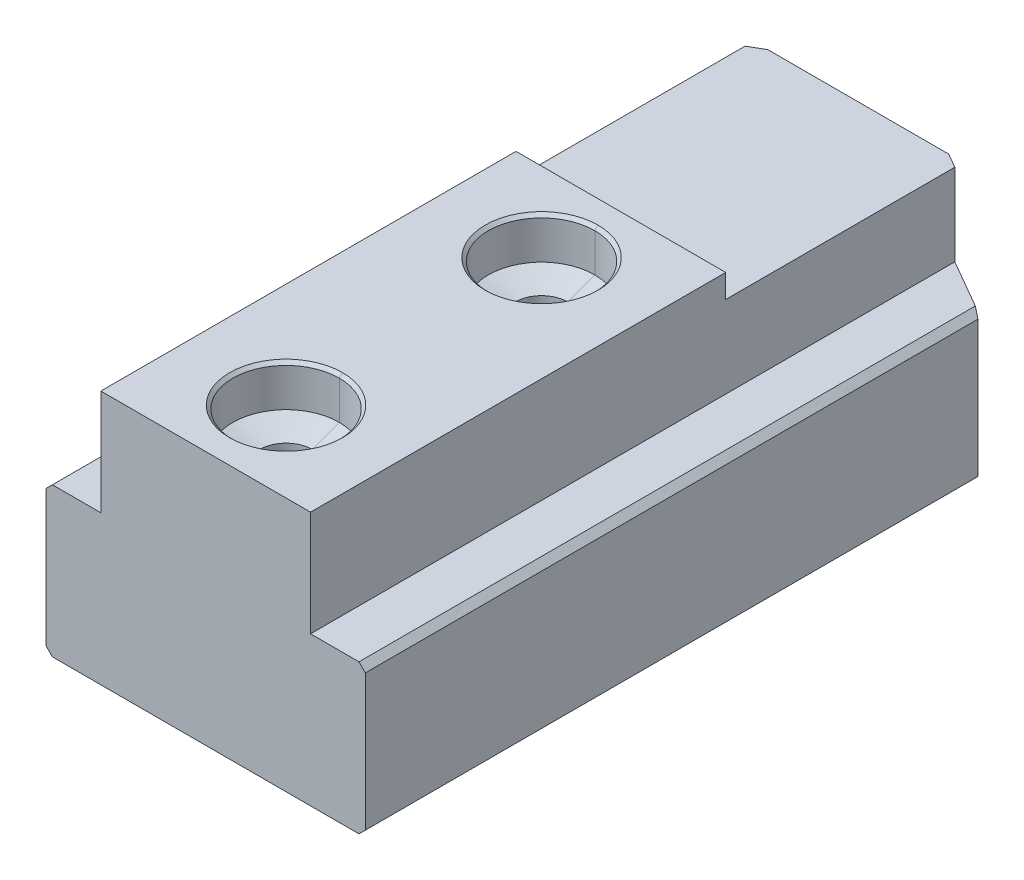
ISO-10303-21;
HEADER;
FILE_DESCRIPTION(('STEP AP214'),'2;1');
FILE_NAME('part.step','',(''),(''),'','','');
FILE_SCHEMA(('AUTOMOTIVE_DESIGN { 1 0 10303 214 1 1 1 1 }'));
ENDSEC;
DATA;
#1=APPLICATION_CONTEXT('core data for automotive mechanical design processes');
#2=APPLICATION_PROTOCOL_DEFINITION('international standard','automotive_design',2000,#1);
#3=PRODUCT_CONTEXT('',#1,'mechanical');
#4=PRODUCT('Part','Part','',(#3));
#5=PRODUCT_RELATED_PRODUCT_CATEGORY('part','',(#4));
#6=PRODUCT_DEFINITION_FORMATION('','',#4);
#7=PRODUCT_DEFINITION_CONTEXT('part definition',#1,'design');
#8=PRODUCT_DEFINITION('design','',#6,#7);
#9=PRODUCT_DEFINITION_SHAPE('','',#8);
#10=(LENGTH_UNIT() NAMED_UNIT(*) SI_UNIT(.MILLI.,.METRE.));
#11=(NAMED_UNIT(*) PLANE_ANGLE_UNIT() SI_UNIT($,.RADIAN.));
#12=(NAMED_UNIT(*) SI_UNIT($,.STERADIAN.) SOLID_ANGLE_UNIT());
#13=UNCERTAINTY_MEASURE_WITH_UNIT(LENGTH_MEASURE(1.E-05),#10,'distance_accuracy_value','');
#14=(GEOMETRIC_REPRESENTATION_CONTEXT(3) GLOBAL_UNCERTAINTY_ASSIGNED_CONTEXT((#13)) GLOBAL_UNIT_ASSIGNED_CONTEXT((#10,
#11,#12)) REPRESENTATION_CONTEXT('',''));
#15=CARTESIAN_POINT('',(0.,0.,0.));
#16=DIRECTION('',(0.,0.,1.));
#17=DIRECTION('',(1.,0.,0.));
#18=AXIS2_PLACEMENT_3D('',#15,#16,#17);
#19=CARTESIAN_POINT('',(0.,0.,0.));
#20=DIRECTION('',(0.,0.,1.));
#21=DIRECTION('',(1.,0.,0.));
#22=AXIS2_PLACEMENT_3D('',#19,#20,#21);
#23=PLANE('',#22);
#24=DIRECTION('',(0.,-1.,0.));
#25=VECTOR('',#24,1.);
#26=CARTESIAN_POINT('',(8.5,23.9,0.));
#27=LINE('',#26,#25);
#28=CARTESIAN_POINT('',(8.5,21.7,0.));
#29=VERTEX_POINT('',#28);
#30=CARTESIAN_POINT('',(8.5,0.,0.));
#31=VERTEX_POINT('',#30);
#32=EDGE_CURVE('E11',#29,#31,#27,.T.);
#33=ORIENTED_EDGE('',*,*,#32,.T.);
#34=DIRECTION('',(1.,0.,0.));
#35=VECTOR('',#34,1.);
#36=CARTESIAN_POINT('',(-14.4,0.,0.));
#37=LINE('',#36,#35);
#38=CARTESIAN_POINT('',(-8.5,0.,0.));
#39=VERTEX_POINT('',#38);
#40=EDGE_CURVE('E26',#39,#31,#37,.T.);
#41=ORIENTED_EDGE('',*,*,#40,.F.);
#42=DIRECTION('',(0.,-1.,0.));
#43=VECTOR('',#42,1.);
#44=CARTESIAN_POINT('',(-8.5,23.9,0.));
#45=LINE('',#44,#43);
#46=CARTESIAN_POINT('',(-8.5,21.7,0.));
#47=VERTEX_POINT('',#46);
#48=EDGE_CURVE('E706',#47,#39,#45,.T.);
#49=ORIENTED_EDGE('',*,*,#48,.F.);
#50=DIRECTION('',(-1.,0.,0.));
#51=VECTOR('',#50,1.);
#52=CARTESIAN_POINT('',(15.,21.7,0.));
#53=LINE('',#52,#51);
#54=EDGE_CURVE('E700',#29,#47,#53,.T.);
#55=ORIENTED_EDGE('',*,*,#54,.F.);
#56=EDGE_LOOP('',(#33,#41,#49,#55));
#57=FACE_BOUND('',#56,.T.);
#58=ADVANCED_FACE('F17',(#57),#23,.F.);
#59=CARTESIAN_POINT('',(0.,21.7,0.));
#60=DIRECTION('',(0.,1.,0.));
#61=DIRECTION('',(0.,0.,1.));
#62=AXIS2_PLACEMENT_3D('',#59,#60,#61);
#63=PLANE('',#62);
#64=DIRECTION('',(0.,0.,-1.));
#65=VECTOR('',#64,1.);
#66=CARTESIAN_POINT('',(9.85,21.7,61.3));
#67=LINE('',#66,#65);
#68=CARTESIAN_POINT('',(9.85,21.7,22.3));
#69=VERTEX_POINT('',#68);
#70=CARTESIAN_POINT('',(9.85,21.7,0.779422863406001));
#71=VERTEX_POINT('',#70);
#72=EDGE_CURVE('E695',#69,#71,#67,.T.);
#73=ORIENTED_EDGE('',*,*,#72,.T.);
#74=DIRECTION('',(-0.866025403784438,0.,-0.500000000000001));
#75=VECTOR('',#74,1.);
#76=CARTESIAN_POINT('',(2.12500000000003,21.7,-3.68060796608388));
#77=LINE('',#76,#75);
#78=EDGE_CURVE('E689',#71,#29,#77,.T.);
#79=ORIENTED_EDGE('',*,*,#78,.T.);
#80=ORIENTED_EDGE('',*,*,#54,.T.);
#81=DIRECTION('',(-0.866025403784438,0.,0.500000000000001));
#82=VECTOR('',#81,1.);
#83=CARTESIAN_POINT('',(-2.12500000000003,21.7,-3.68060796608388));
#84=LINE('',#83,#82);
#85=CARTESIAN_POINT('',(-9.85,21.7,0.77942286340601));
#86=VERTEX_POINT('',#85);
#87=EDGE_CURVE('E684',#47,#86,#84,.T.);
#88=ORIENTED_EDGE('',*,*,#87,.T.);
#89=DIRECTION('',(0.,0.,1.));
#90=VECTOR('',#89,1.);
#91=CARTESIAN_POINT('',(-9.85,21.7,61.3));
#92=LINE('',#91,#90);
#93=CARTESIAN_POINT('',(-9.85,21.7,22.3));
#94=VERTEX_POINT('',#93);
#95=EDGE_CURVE('E679',#86,#94,#92,.T.);
#96=ORIENTED_EDGE('',*,*,#95,.T.);
#97=DIRECTION('',(1.,0.,0.));
#98=VECTOR('',#97,1.);
#99=CARTESIAN_POINT('',(-15.,21.7,22.3));
#100=LINE('',#99,#98);
#101=EDGE_CURVE('E674',#94,#69,#100,.T.);
#102=ORIENTED_EDGE('',*,*,#101,.T.);
#103=EDGE_LOOP('',(#73,#79,#80,#88,#96,#102));
#104=FACE_BOUND('',#103,.T.);
#105=ADVANCED_FACE('F728',(#104),#63,.T.);
#106=CARTESIAN_POINT('',(-15.,21.7,22.3));
#107=DIRECTION('',(0.,0.,1.));
#108=DIRECTION('',(1.,0.,0.));
#109=AXIS2_PLACEMENT_3D('',#106,#107,#108);
#110=PLANE('',#109);
#111=ORIENTED_EDGE('',*,*,#101,.F.);
#112=DIRECTION('',(0.,-1.,0.));
#113=VECTOR('',#112,1.);
#114=CARTESIAN_POINT('',(-9.85,23.9,22.3));
#115=LINE('',#114,#113);
#116=CARTESIAN_POINT('',(-9.85,23.9,22.3));
#117=VERTEX_POINT('',#116);
#118=EDGE_CURVE('E668',#117,#94,#115,.T.);
#119=ORIENTED_EDGE('',*,*,#118,.F.);
#120=DIRECTION('',(1.,0.,0.));
#121=VECTOR('',#120,1.);
#122=CARTESIAN_POINT('',(-15.,23.9,22.3));
#123=LINE('',#122,#121);
#124=CARTESIAN_POINT('',(9.85,23.9,22.3));
#125=VERTEX_POINT('',#124);
#126=EDGE_CURVE('E663',#117,#125,#123,.T.);
#127=ORIENTED_EDGE('',*,*,#126,.T.);
#128=DIRECTION('',(0.,1.,0.));
#129=VECTOR('',#128,1.);
#130=CARTESIAN_POINT('',(9.85,14.,22.3));
#131=LINE('',#130,#129);
#132=EDGE_CURVE('E657',#69,#125,#131,.T.);
#133=ORIENTED_EDGE('',*,*,#132,.F.);
#134=EDGE_LOOP('',(#111,#119,#127,#133));
#135=FACE_BOUND('',#134,.T.);
#136=ADVANCED_FACE('F764',(#135),#110,.F.);
#137=CARTESIAN_POINT('',(9.85,14.,61.3));
#138=DIRECTION('',(-1.,0.,0.));
#139=DIRECTION('',(0.,0.,1.));
#140=AXIS2_PLACEMENT_3D('',#137,#138,#139);
#141=PLANE('',#140);
#142=DIRECTION('',(0.,-1.,0.));
#143=VECTOR('',#142,1.);
#144=CARTESIAN_POINT('',(9.85,14.,0.779422863406001));
#145=LINE('',#144,#143);
#146=CARTESIAN_POINT('',(9.85,14.,0.779422863406001));
#147=VERTEX_POINT('',#146);
#148=EDGE_CURVE('E651',#71,#147,#145,.T.);
#149=ORIENTED_EDGE('',*,*,#148,.F.);
#150=ORIENTED_EDGE('',*,*,#72,.F.);
#151=ORIENTED_EDGE('',*,*,#132,.T.);
#152=DIRECTION('',(0.,0.,-1.));
#153=VECTOR('',#152,1.);
#154=CARTESIAN_POINT('',(9.85,23.9,61.3));
#155=LINE('',#154,#153);
#156=CARTESIAN_POINT('',(9.85,23.9,61.3));
#157=VERTEX_POINT('',#156);
#158=EDGE_CURVE('E645',#157,#125,#155,.T.);
#159=ORIENTED_EDGE('',*,*,#158,.F.);
#160=DIRECTION('',(0.,1.,0.));
#161=VECTOR('',#160,1.);
#162=CARTESIAN_POINT('',(9.85,14.,61.3));
#163=LINE('',#162,#161);
#164=CARTESIAN_POINT('',(9.85,14.,61.3));
#165=VERTEX_POINT('',#164);
#166=EDGE_CURVE('E639',#165,#157,#163,.T.);
#167=ORIENTED_EDGE('',*,*,#166,.F.);
#168=DIRECTION('',(0.,0.,-1.));
#169=VECTOR('',#168,1.);
#170=CARTESIAN_POINT('',(9.85,14.,61.3));
#171=LINE('',#170,#169);
#172=EDGE_CURVE('E634',#165,#147,#171,.T.);
#173=ORIENTED_EDGE('',*,*,#172,.T.);
#174=EDGE_LOOP('',(#149,#150,#151,#159,#167,#173));
#175=FACE_BOUND('',#174,.T.);
#176=ADVANCED_FACE('F767',(#175),#141,.F.);
#177=CARTESIAN_POINT('',(14.4,14.,61.3));
#178=DIRECTION('',(0.,-1.,0.));
#179=DIRECTION('',(0.,0.,-1.));
#180=AXIS2_PLACEMENT_3D('',#177,#178,#179);
#181=PLANE('',#180);
#182=DIRECTION('',(0.866025403784438,0.,0.500000000000001));
#183=VECTOR('',#182,1.);
#184=CARTESIAN_POINT('',(39.4686786259932,14.,17.8797749411643));
#185=LINE('',#184,#183);
#186=CARTESIAN_POINT('',(14.4,14.,3.40636658821883));
#187=VERTEX_POINT('',#186);
#188=EDGE_CURVE('E628',#147,#187,#185,.T.);
#189=ORIENTED_EDGE('',*,*,#188,.F.);
#190=ORIENTED_EDGE('',*,*,#172,.F.);
#191=DIRECTION('',(-1.,0.,0.));
#192=VECTOR('',#191,1.);
#193=CARTESIAN_POINT('',(14.4,14.,61.3));
#194=LINE('',#193,#192);
#195=CARTESIAN_POINT('',(14.4,14.,61.3));
#196=VERTEX_POINT('',#195);
#197=EDGE_CURVE('E622',#196,#165,#194,.T.);
#198=ORIENTED_EDGE('',*,*,#197,.F.);
#199=DIRECTION('',(0.,0.,-1.));
#200=VECTOR('',#199,1.);
#201=CARTESIAN_POINT('',(14.4,14.,61.3));
#202=LINE('',#201,#200);
#203=EDGE_CURVE('E617',#196,#187,#202,.T.);
#204=ORIENTED_EDGE('',*,*,#203,.T.);
#205=EDGE_LOOP('',(#189,#190,#198,#204));
#206=FACE_BOUND('',#205,.T.);
#207=ADVANCED_FACE('F772',(#206),#181,.F.);
#208=CARTESIAN_POINT('',(15.,13.4,61.3));
#209=DIRECTION('',(-0.707106781186549,-0.707106781186547,0.));
#210=DIRECTION('',(0.707106781186547,-0.707106781186549,0.));
#211=AXIS2_PLACEMENT_3D('',#208,#209,#210);
#212=PLANE('',#211);
#213=DIRECTION('',(0.654653670707976,-0.654653670707977,0.377964473009229));
#214=VECTOR('',#213,1.);
#215=CARTESIAN_POINT('',(29.239244929139,-0.83924492913897,11.973808642628));
#216=LINE('',#215,#214);
#217=CARTESIAN_POINT('',(15.,13.4,3.7527767497326));
#218=VERTEX_POINT('',#217);
#219=EDGE_CURVE('E611',#187,#218,#216,.T.);
#220=ORIENTED_EDGE('',*,*,#219,.F.);
#221=ORIENTED_EDGE('',*,*,#203,.F.);
#222=DIRECTION('',(-0.707106781186547,0.707106781186549,0.));
#223=VECTOR('',#222,1.);
#224=CARTESIAN_POINT('',(15.,13.4,61.3));
#225=LINE('',#224,#223);
#226=CARTESIAN_POINT('',(15.,13.4,61.3));
#227=VERTEX_POINT('',#226);
#228=EDGE_CURVE('E605',#227,#196,#225,.T.);
#229=ORIENTED_EDGE('',*,*,#228,.F.);
#230=DIRECTION('',(0.,0.,-1.));
#231=VECTOR('',#230,1.);
#232=CARTESIAN_POINT('',(15.,13.4,61.3));
#233=LINE('',#232,#231);
#234=EDGE_CURVE('E600',#227,#218,#233,.T.);
#235=ORIENTED_EDGE('',*,*,#234,.T.);
#236=EDGE_LOOP('',(#220,#221,#229,#235));
#237=FACE_BOUND('',#236,.T.);
#238=ADVANCED_FACE('F775',(#237),#212,.F.);
#239=CARTESIAN_POINT('',(15.,0.6,61.3));
#240=DIRECTION('',(-1.,0.,0.));
#241=DIRECTION('',(0.,0.,1.));
#242=AXIS2_PLACEMENT_3D('',#239,#240,#241);
#243=PLANE('',#242);
#244=DIRECTION('',(0.,-1.,0.));
#245=VECTOR('',#244,1.);
#246=CARTESIAN_POINT('',(15.,23.9,3.7527767497326));
#247=LINE('',#246,#245);
#248=CARTESIAN_POINT('',(15.,0.600000000000007,3.7527767497326));
#249=VERTEX_POINT('',#248);
#250=EDGE_CURVE('E594',#218,#249,#247,.T.);
#251=ORIENTED_EDGE('',*,*,#250,.F.);
#252=ORIENTED_EDGE('',*,*,#234,.F.);
#253=DIRECTION('',(0.,1.,0.));
#254=VECTOR('',#253,1.);
#255=CARTESIAN_POINT('',(15.,0.6,61.3));
#256=LINE('',#255,#254);
#257=CARTESIAN_POINT('',(15.,0.6,61.3));
#258=VERTEX_POINT('',#257);
#259=EDGE_CURVE('E588',#258,#227,#256,.T.);
#260=ORIENTED_EDGE('',*,*,#259,.F.);
#261=DIRECTION('',(0.,0.,-1.));
#262=VECTOR('',#261,1.);
#263=CARTESIAN_POINT('',(15.,0.6,61.3));
#264=LINE('',#263,#262);
#265=EDGE_CURVE('E583',#258,#249,#264,.T.);
#266=ORIENTED_EDGE('',*,*,#265,.T.);
#267=EDGE_LOOP('',(#251,#252,#260,#266));
#268=FACE_BOUND('',#267,.T.);
#269=ADVANCED_FACE('F778',(#268),#243,.F.);
#270=CARTESIAN_POINT('',(14.4,0.,61.3));
#271=DIRECTION('',(-0.707106781186549,0.707106781186547,0.));
#272=DIRECTION('',(-0.707106781186547,-0.707106781186549,0.));
#273=AXIS2_PLACEMENT_3D('',#270,#271,#272);
#274=PLANE('',#273);
#275=DIRECTION('',(-0.654653670707975,-0.654653670707977,-0.37796447300923));
#276=VECTOR('',#275,1.);
#277=CARTESIAN_POINT('',(28.7249592148532,14.3249592148533,11.6768856470448));
#278=LINE('',#277,#276);
#279=CARTESIAN_POINT('',(14.4,0.,3.40636658821882));
#280=VERTEX_POINT('',#279);
#281=EDGE_CURVE('E577',#249,#280,#278,.T.);
#282=ORIENTED_EDGE('',*,*,#281,.F.);
#283=ORIENTED_EDGE('',*,*,#265,.F.);
#284=DIRECTION('',(0.707106781186547,0.707106781186549,0.));
#285=VECTOR('',#284,1.);
#286=CARTESIAN_POINT('',(14.4,0.,61.3));
#287=LINE('',#286,#285);
#288=CARTESIAN_POINT('',(14.4,0.,61.3));
#289=VERTEX_POINT('',#288);
#290=EDGE_CURVE('E571',#289,#258,#287,.T.);
#291=ORIENTED_EDGE('',*,*,#290,.F.);
#292=DIRECTION('',(0.,0.,-1.));
#293=VECTOR('',#292,1.);
#294=CARTESIAN_POINT('',(14.4,0.,61.3));
#295=LINE('',#294,#293);
#296=EDGE_CURVE('E566',#289,#280,#295,.T.);
#297=ORIENTED_EDGE('',*,*,#296,.T.);
#298=EDGE_LOOP('',(#282,#283,#291,#297));
#299=FACE_BOUND('',#298,.T.);
#300=ADVANCED_FACE('F737',(#299),#274,.F.);
#301=CARTESIAN_POINT('',(-14.4,0.,61.3));
#302=DIRECTION('',(0.,1.,0.));
#303=DIRECTION('',(0.,0.,1.));
#304=AXIS2_PLACEMENT_3D('',#301,#302,#303);
#305=PLANE('',#304);
#306=DIRECTION('',(0.866025403784438,0.,0.500000000000001));
#307=VECTOR('',#306,1.);
#308=CARTESIAN_POINT('',(8.5,0.,0.));
#309=LINE('',#308,#307);
#310=EDGE_CURVE('E560',#31,#280,#309,.T.);
#311=ORIENTED_EDGE('',*,*,#310,.T.);
#312=ORIENTED_EDGE('',*,*,#296,.F.);
#313=DIRECTION('',(1.,0.,0.));
#314=VECTOR('',#313,1.);
#315=CARTESIAN_POINT('',(-14.4,0.,61.3));
#316=LINE('',#315,#314);
#317=CARTESIAN_POINT('',(-14.4,0.,61.3));
#318=VERTEX_POINT('',#317);
#319=EDGE_CURVE('E554',#318,#289,#316,.T.);
#320=ORIENTED_EDGE('',*,*,#319,.F.);
#321=DIRECTION('',(0.,0.,-1.));
#322=VECTOR('',#321,1.);
#323=CARTESIAN_POINT('',(-14.4,0.,61.3));
#324=LINE('',#323,#322);
#325=CARTESIAN_POINT('',(-14.4,0.,3.40636658821882));
#326=VERTEX_POINT('',#325);
#327=EDGE_CURVE('E549',#318,#326,#324,.T.);
#328=ORIENTED_EDGE('',*,*,#327,.T.);
#329=DIRECTION('',(0.866025403784438,0.,-0.500000000000001));
#330=VECTOR('',#329,1.);
#331=CARTESIAN_POINT('',(-15.,0.,3.7527767497326));
#332=LINE('',#331,#330);
#333=EDGE_CURVE('E544',#326,#39,#332,.T.);
#334=ORIENTED_EDGE('',*,*,#333,.T.);
#335=ORIENTED_EDGE('',*,*,#40,.T.);
#336=EDGE_LOOP('',(#311,#312,#320,#328,#334,#335));
#337=FACE_BOUND('',#336,.T.);
#338=ADVANCED_FACE('F718',(#337),#305,.F.);
#339=CARTESIAN_POINT('',(-15.,23.9,3.7527767497326));
#340=DIRECTION('',(-0.500000000000001,0.,-0.866025403784438));
#341=DIRECTION('',(-0.866025403784438,0.,0.500000000000001));
#342=AXIS2_PLACEMENT_3D('',#339,#340,#341);
#343=PLANE('',#342);
#344=DIRECTION('',(-0.654653670707975,0.654653670707977,0.37796447300923));
#345=VECTOR('',#344,1.);
#346=CARTESIAN_POINT('',(-29.239244929139,14.839244929139,11.973808642628));
#347=LINE('',#346,#345);
#348=CARTESIAN_POINT('',(-15.,0.6,3.7527767497326));
#349=VERTEX_POINT('',#348);
#350=EDGE_CURVE('E539',#326,#349,#347,.T.);
#351=ORIENTED_EDGE('',*,*,#350,.T.);
#352=DIRECTION('',(0.,-1.,0.));
#353=VECTOR('',#352,1.);
#354=CARTESIAN_POINT('',(-15.,23.9,3.7527767497326));
#355=LINE('',#354,#353);
#356=CARTESIAN_POINT('',(-15.,13.4,3.7527767497326));
#357=VERTEX_POINT('',#356);
#358=EDGE_CURVE('E533',#357,#349,#355,.T.);
#359=ORIENTED_EDGE('',*,*,#358,.F.);
#360=DIRECTION('',(0.654653670707976,0.654653670707977,-0.377964473009229));
#361=VECTOR('',#360,1.);
#362=CARTESIAN_POINT('',(-28.7249592148532,-0.324959214853256,11.6768856470448));
#363=LINE('',#362,#361);
#364=CARTESIAN_POINT('',(-14.4,14.,3.40636658821883));
#365=VERTEX_POINT('',#364);
#366=EDGE_CURVE('E528',#357,#365,#363,.T.);
#367=ORIENTED_EDGE('',*,*,#366,.T.);
#368=DIRECTION('',(0.866025403784438,0.,-0.500000000000001));
#369=VECTOR('',#368,1.);
#370=CARTESIAN_POINT('',(-36.0561786259931,14.,15.9095671475547));
#371=LINE('',#370,#369);
#372=CARTESIAN_POINT('',(-9.85,14.,0.779422863406008));
#373=VERTEX_POINT('',#372);
#374=EDGE_CURVE('E523',#365,#373,#371,.T.);
#375=ORIENTED_EDGE('',*,*,#374,.T.);
#376=DIRECTION('',(0.,1.,0.));
#377=VECTOR('',#376,1.);
#378=CARTESIAN_POINT('',(-9.85,23.9,0.779422863406008));
#379=LINE('',#378,#377);
#380=EDGE_CURVE('E517',#373,#86,#379,.T.);
#381=ORIENTED_EDGE('',*,*,#380,.T.);
#382=ORIENTED_EDGE('',*,*,#87,.F.);
#383=ORIENTED_EDGE('',*,*,#48,.T.);
#384=ORIENTED_EDGE('',*,*,#333,.F.);
#385=EDGE_LOOP('',(#351,#359,#367,#375,#381,#382,#383,#384));
#386=FACE_BOUND('',#385,.T.);
#387=ADVANCED_FACE('F725',(#386),#343,.T.);
#388=CARTESIAN_POINT('',(-9.85,23.9,61.3));
#389=DIRECTION('',(1.,0.,0.));
#390=DIRECTION('',(0.,0.,-1.));
#391=AXIS2_PLACEMENT_3D('',#388,#389,#390);
#392=PLANE('',#391);
#393=ORIENTED_EDGE('',*,*,#380,.F.);
#394=DIRECTION('',(0.,0.,-1.));
#395=VECTOR('',#394,1.);
#396=CARTESIAN_POINT('',(-9.85,14.,61.3));
#397=LINE('',#396,#395);
#398=CARTESIAN_POINT('',(-9.85,14.,61.3));
#399=VERTEX_POINT('',#398);
#400=EDGE_CURVE('E511',#399,#373,#397,.T.);
#401=ORIENTED_EDGE('',*,*,#400,.F.);
#402=DIRECTION('',(0.,-1.,0.));
#403=VECTOR('',#402,1.);
#404=CARTESIAN_POINT('',(-9.85,23.9,61.3));
#405=LINE('',#404,#403);
#406=CARTESIAN_POINT('',(-9.85,23.9,61.3));
#407=VERTEX_POINT('',#406);
#408=EDGE_CURVE('E505',#407,#399,#405,.T.);
#409=ORIENTED_EDGE('',*,*,#408,.F.);
#410=DIRECTION('',(0.,0.,-1.));
#411=VECTOR('',#410,1.);
#412=CARTESIAN_POINT('',(-9.85,23.9,61.3));
#413=LINE('',#412,#411);
#414=EDGE_CURVE('E499',#407,#117,#413,.T.);
#415=ORIENTED_EDGE('',*,*,#414,.T.);
#416=ORIENTED_EDGE('',*,*,#118,.T.);
#417=ORIENTED_EDGE('',*,*,#95,.F.);
#418=EDGE_LOOP('',(#393,#401,#409,#415,#416,#417));
#419=FACE_BOUND('',#418,.T.);
#420=ADVANCED_FACE('F760',(#419),#392,.F.);
#421=CARTESIAN_POINT('',(9.85,23.9,61.3));
#422=DIRECTION('',(0.,-1.,0.));
#423=DIRECTION('',(0.,0.,-1.));
#424=AXIS2_PLACEMENT_3D('',#421,#422,#423);
#425=PLANE('',#424);
#426=CARTESIAN_POINT('',(0.,23.9,29.75));
#427=DIRECTION('',(0.,-1.,0.));
#428=DIRECTION('',(0.,0.,-1.));
#429=AXIS2_PLACEMENT_3D('',#426,#427,#428);
#430=CIRCLE('',#429,5.3);
#431=CARTESIAN_POINT('',(0.,23.9,24.45));
#432=VERTEX_POINT('',#431);
#433=CARTESIAN_POINT('',(0.,23.9,35.05));
#434=VERTEX_POINT('',#433);
#435=EDGE_CURVE('E494',#432,#434,#430,.T.);
#436=ORIENTED_EDGE('',*,*,#435,.T.);
#437=CARTESIAN_POINT('',(0.,23.9,29.75));
#438=DIRECTION('',(0.,-1.,0.));
#439=DIRECTION('',(0.,0.,-1.));
#440=AXIS2_PLACEMENT_3D('',#437,#438,#439);
#441=CIRCLE('',#440,5.3);
#442=EDGE_CURVE('E489',#434,#432,#441,.T.);
#443=ORIENTED_EDGE('',*,*,#442,.T.);
#444=EDGE_LOOP('',(#436,#443));
#445=FACE_BOUND('',#444,.T.);
#446=CARTESIAN_POINT('',(0.,23.9,53.75));
#447=DIRECTION('',(0.,-1.,0.));
#448=DIRECTION('',(0.,0.,-1.));
#449=AXIS2_PLACEMENT_3D('',#446,#447,#448);
#450=CIRCLE('',#449,5.3);
#451=CARTESIAN_POINT('',(0.,23.9,48.45));
#452=VERTEX_POINT('',#451);
#453=CARTESIAN_POINT('',(0.,23.9,59.05));
#454=VERTEX_POINT('',#453);
#455=EDGE_CURVE('E484',#452,#454,#450,.T.);
#456=ORIENTED_EDGE('',*,*,#455,.T.);
#457=CARTESIAN_POINT('',(0.,23.9,53.75));
#458=DIRECTION('',(0.,-1.,0.));
#459=DIRECTION('',(0.,0.,-1.));
#460=AXIS2_PLACEMENT_3D('',#457,#458,#459);
#461=CIRCLE('',#460,5.3);
#462=EDGE_CURVE('E479',#454,#452,#461,.T.);
#463=ORIENTED_EDGE('',*,*,#462,.T.);
#464=EDGE_LOOP('',(#456,#463));
#465=FACE_BOUND('',#464,.T.);
#466=ORIENTED_EDGE('',*,*,#158,.T.);
#467=ORIENTED_EDGE('',*,*,#126,.F.);
#468=ORIENTED_EDGE('',*,*,#414,.F.);
#469=DIRECTION('',(-1.,0.,0.));
#470=VECTOR('',#469,1.);
#471=CARTESIAN_POINT('',(9.85,23.9,61.3));
#472=LINE('',#471,#470);
#473=EDGE_CURVE('E473',#157,#407,#472,.T.);
#474=ORIENTED_EDGE('',*,*,#473,.F.);
#475=EDGE_LOOP('',(#466,#467,#468,#474));
#476=FACE_BOUND('',#475,.T.);
#477=ADVANCED_FACE('F782',(#445,#465,#476),#425,.F.);
#478=CARTESIAN_POINT('',(0.,0.,61.3));
#479=DIRECTION('',(0.,0.,1.));
#480=DIRECTION('',(1.,0.,0.));
#481=AXIS2_PLACEMENT_3D('',#478,#479,#480);
#482=PLANE('',#481);
#483=DIRECTION('',(-0.707106781186547,-0.707106781186549,0.));
#484=VECTOR('',#483,1.);
#485=CARTESIAN_POINT('',(-14.4,14.,61.3));
#486=LINE('',#485,#484);
#487=CARTESIAN_POINT('',(-14.4,14.,61.3));
#488=VERTEX_POINT('',#487);
#489=CARTESIAN_POINT('',(-15.,13.4,61.3));
#490=VERTEX_POINT('',#489);
#491=EDGE_CURVE('E468',#488,#490,#486,.T.);
#492=ORIENTED_EDGE('',*,*,#491,.T.);
#493=DIRECTION('',(0.,-1.,0.));
#494=VECTOR('',#493,1.);
#495=CARTESIAN_POINT('',(-15.,13.4,61.3));
#496=LINE('',#495,#494);
#497=CARTESIAN_POINT('',(-15.,0.6,61.3));
#498=VERTEX_POINT('',#497);
#499=EDGE_CURVE('E463',#490,#498,#496,.T.);
#500=ORIENTED_EDGE('',*,*,#499,.T.);
#501=DIRECTION('',(0.707106781186547,-0.707106781186549,0.));
#502=VECTOR('',#501,1.);
#503=CARTESIAN_POINT('',(-15.,0.6,61.3));
#504=LINE('',#503,#502);
#505=EDGE_CURVE('E457',#498,#318,#504,.T.);
#506=ORIENTED_EDGE('',*,*,#505,.T.);
#507=ORIENTED_EDGE('',*,*,#319,.T.);
#508=ORIENTED_EDGE('',*,*,#290,.T.);
#509=ORIENTED_EDGE('',*,*,#259,.T.);
#510=ORIENTED_EDGE('',*,*,#228,.T.);
#511=ORIENTED_EDGE('',*,*,#197,.T.);
#512=ORIENTED_EDGE('',*,*,#166,.T.);
#513=ORIENTED_EDGE('',*,*,#473,.T.);
#514=ORIENTED_EDGE('',*,*,#408,.T.);
#515=DIRECTION('',(-1.,0.,0.));
#516=VECTOR('',#515,1.);
#517=CARTESIAN_POINT('',(-9.85,14.,61.3));
#518=LINE('',#517,#516);
#519=EDGE_CURVE('E452',#399,#488,#518,.T.);
#520=ORIENTED_EDGE('',*,*,#519,.T.);
#521=EDGE_LOOP('',(#492,#500,#506,#507,#508,#509,#510,#511,#512,#513,#514,#520));
#522=FACE_BOUND('',#521,.T.);
#523=ADVANCED_FACE('F740',(#522),#482,.T.);
#524=CARTESIAN_POINT('',(-9.85,14.,61.3));
#525=DIRECTION('',(0.,-1.,0.));
#526=DIRECTION('',(0.,0.,-1.));
#527=AXIS2_PLACEMENT_3D('',#524,#525,#526);
#528=PLANE('',#527);
#529=ORIENTED_EDGE('',*,*,#374,.F.);
#530=DIRECTION('',(0.,0.,-1.));
#531=VECTOR('',#530,1.);
#532=CARTESIAN_POINT('',(-14.4,14.,61.3));
#533=LINE('',#532,#531);
#534=EDGE_CURVE('E446',#488,#365,#533,.T.);
#535=ORIENTED_EDGE('',*,*,#534,.F.);
#536=ORIENTED_EDGE('',*,*,#519,.F.);
#537=ORIENTED_EDGE('',*,*,#400,.T.);
#538=EDGE_LOOP('',(#529,#535,#536,#537));
#539=FACE_BOUND('',#538,.T.);
#540=ADVANCED_FACE('F756',(#539),#528,.F.);
#541=CARTESIAN_POINT('',(-14.4,14.,61.3));
#542=DIRECTION('',(0.707106781186549,-0.707106781186547,0.));
#543=DIRECTION('',(0.707106781186547,0.707106781186549,0.));
#544=AXIS2_PLACEMENT_3D('',#541,#542,#543);
#545=PLANE('',#544);
#546=ORIENTED_EDGE('',*,*,#366,.F.);
#547=DIRECTION('',(0.,0.,-1.));
#548=VECTOR('',#547,1.);
#549=CARTESIAN_POINT('',(-15.,13.4,61.3));
#550=LINE('',#549,#548);
#551=EDGE_CURVE('E440',#490,#357,#550,.T.);
#552=ORIENTED_EDGE('',*,*,#551,.F.);
#553=ORIENTED_EDGE('',*,*,#491,.F.);
#554=ORIENTED_EDGE('',*,*,#534,.T.);
#555=EDGE_LOOP('',(#546,#552,#553,#554));
#556=FACE_BOUND('',#555,.T.);
#557=ADVANCED_FACE('F751',(#556),#545,.F.);
#558=CARTESIAN_POINT('',(-15.,13.4,61.3));
#559=DIRECTION('',(1.,0.,0.));
#560=DIRECTION('',(0.,0.,-1.));
#561=AXIS2_PLACEMENT_3D('',#558,#559,#560);
#562=PLANE('',#561);
#563=ORIENTED_EDGE('',*,*,#358,.T.);
#564=DIRECTION('',(0.,0.,-1.));
#565=VECTOR('',#564,1.);
#566=CARTESIAN_POINT('',(-15.,0.6,61.3));
#567=LINE('',#566,#565);
#568=EDGE_CURVE('E434',#498,#349,#567,.T.);
#569=ORIENTED_EDGE('',*,*,#568,.F.);
#570=ORIENTED_EDGE('',*,*,#499,.F.);
#571=ORIENTED_EDGE('',*,*,#551,.T.);
#572=EDGE_LOOP('',(#563,#569,#570,#571));
#573=FACE_BOUND('',#572,.T.);
#574=ADVANCED_FACE('F748',(#573),#562,.F.);
#575=CARTESIAN_POINT('',(-15.,0.6,61.3));
#576=DIRECTION('',(0.707106781186549,0.707106781186547,0.));
#577=DIRECTION('',(-0.707106781186547,0.707106781186549,0.));
#578=AXIS2_PLACEMENT_3D('',#575,#576,#577);
#579=PLANE('',#578);
#580=ORIENTED_EDGE('',*,*,#350,.F.);
#581=ORIENTED_EDGE('',*,*,#327,.F.);
#582=ORIENTED_EDGE('',*,*,#505,.F.);
#583=ORIENTED_EDGE('',*,*,#568,.T.);
#584=EDGE_LOOP('',(#580,#581,#582,#583));
#585=FACE_BOUND('',#584,.T.);
#586=ADVANCED_FACE('F744',(#585),#579,.F.);
#587=CARTESIAN_POINT('',(0.,23.9,53.75));
#588=DIRECTION('',(0.,1.,0.));
#589=DIRECTION('',(1.,0.,0.));
#590=AXIS2_PLACEMENT_3D('',#587,#588,#589);
#591=CONICAL_SURFACE('',#590,5.3,0.785398163397448);
#592=DIRECTION('',(0.,0.707106781186548,-0.707106781186548));
#593=VECTOR('',#592,1.);
#594=CARTESIAN_POINT('',(0.,23.6,48.75));
#595=LINE('',#594,#593);
#596=CARTESIAN_POINT('',(0.,23.6,48.75));
#597=VERTEX_POINT('',#596);
#598=EDGE_CURVE('E428',#597,#452,#595,.T.);
#599=ORIENTED_EDGE('',*,*,#598,.T.);
#600=ORIENTED_EDGE('',*,*,#462,.F.);
#601=DIRECTION('',(0.,0.707106781186548,0.707106781186548));
#602=VECTOR('',#601,1.);
#603=CARTESIAN_POINT('',(0.,23.6,58.75));
#604=LINE('',#603,#602);
#605=CARTESIAN_POINT('',(0.,23.6,58.75));
#606=VERTEX_POINT('',#605);
#607=EDGE_CURVE('E422',#606,#454,#604,.T.);
#608=ORIENTED_EDGE('',*,*,#607,.F.);
#609=CARTESIAN_POINT('',(0.,23.6,53.75));
#610=DIRECTION('',(0.,-1.,0.));
#611=DIRECTION('',(0.,0.,-1.));
#612=AXIS2_PLACEMENT_3D('',#609,#610,#611);
#613=CIRCLE('',#612,5.);
#614=EDGE_CURVE('E417',#606,#597,#613,.T.);
#615=ORIENTED_EDGE('',*,*,#614,.T.);
#616=EDGE_LOOP('',(#599,#600,#608,#615));
#617=FACE_BOUND('',#616,.T.);
#618=ADVANCED_FACE('F872',(#617),#591,.F.);
#619=CARTESIAN_POINT('',(0.,2.1974181429173,53.75));
#620=DIRECTION('',(0.,-1.,0.));
#621=DIRECTION('',(1.,0.,0.));
#622=AXIS2_PLACEMENT_3D('',#619,#620,#621);
#623=CYLINDRICAL_SURFACE('',#622,5.);
#624=DIRECTION('',(0.,-1.,0.));
#625=VECTOR('',#624,1.);
#626=CARTESIAN_POINT('',(0.,23.6,58.75));
#627=LINE('',#626,#625);
#628=CARTESIAN_POINT('',(0.,20.,58.75));
#629=VERTEX_POINT('',#628);
#630=EDGE_CURVE('E412',#606,#629,#627,.T.);
#631=ORIENTED_EDGE('',*,*,#630,.T.);
#632=CARTESIAN_POINT('',(0.,20.,53.75));
#633=DIRECTION('',(0.,-1.,0.));
#634=DIRECTION('',(0.,0.,-1.));
#635=AXIS2_PLACEMENT_3D('',#632,#633,#634);
#636=CIRCLE('',#635,5.);
#637=CARTESIAN_POINT('',(0.,20.,48.75));
#638=VERTEX_POINT('',#637);
#639=EDGE_CURVE('E407',#629,#638,#636,.T.);
#640=ORIENTED_EDGE('',*,*,#639,.T.);
#641=DIRECTION('',(0.,-1.,0.));
#642=VECTOR('',#641,1.);
#643=CARTESIAN_POINT('',(0.,23.6,48.75));
#644=LINE('',#643,#642);
#645=EDGE_CURVE('E401',#597,#638,#644,.T.);
#646=ORIENTED_EDGE('',*,*,#645,.F.);
#647=ORIENTED_EDGE('',*,*,#614,.F.);
#648=EDGE_LOOP('',(#631,#640,#646,#647));
#649=FACE_BOUND('',#648,.T.);
#650=ADVANCED_FACE('F881',(#649),#623,.F.);
#651=CARTESIAN_POINT('',(0.,2.1974181429173,53.75));
#652=DIRECTION('',(0.,-1.,0.));
#653=DIRECTION('',(-1.,0.,0.));
#654=AXIS2_PLACEMENT_3D('',#651,#652,#653);
#655=CYLINDRICAL_SURFACE('',#654,5.);
#656=ORIENTED_EDGE('',*,*,#630,.F.);
#657=CARTESIAN_POINT('',(0.,23.6,53.75));
#658=DIRECTION('',(0.,-1.,0.));
#659=DIRECTION('',(0.,0.,-1.));
#660=AXIS2_PLACEMENT_3D('',#657,#658,#659);
#661=CIRCLE('',#660,5.);
#662=EDGE_CURVE('E395',#597,#606,#661,.T.);
#663=ORIENTED_EDGE('',*,*,#662,.F.);
#664=ORIENTED_EDGE('',*,*,#645,.T.);
#665=CARTESIAN_POINT('',(0.,20.,53.75));
#666=DIRECTION('',(0.,-1.,0.));
#667=DIRECTION('',(0.,0.,-1.));
#668=AXIS2_PLACEMENT_3D('',#665,#666,#667);
#669=CIRCLE('',#668,5.);
#670=EDGE_CURVE('E389',#638,#629,#669,.T.);
#671=ORIENTED_EDGE('',*,*,#670,.T.);
#672=EDGE_LOOP('',(#656,#663,#664,#671));
#673=FACE_BOUND('',#672,.T.);
#674=ADVANCED_FACE('F891',(#673),#655,.F.);
#675=CARTESIAN_POINT('',(0.,20.,53.75));
#676=DIRECTION('',(0.,1.,0.));
#677=DIRECTION('',(-1.,0.,0.));
#678=AXIS2_PLACEMENT_3D('',#675,#676,#677);
#679=CONICAL_SURFACE('',#678,5.,1.22173047639587);
#680=DIRECTION('',(0.,0.342020143325816,-0.939692620785855));
#681=VECTOR('',#680,1.);
#682=CARTESIAN_POINT('',(0.,19.074969649612,51.2915));
#683=LINE('',#682,#681);
#684=CARTESIAN_POINT('',(0.,19.074969649612,51.2915));
#685=VERTEX_POINT('',#684);
#686=EDGE_CURVE('E383',#685,#638,#683,.T.);
#687=ORIENTED_EDGE('',*,*,#686,.F.);
#688=CARTESIAN_POINT('',(0.,19.074969649612,53.75));
#689=DIRECTION('',(0.,-1.,0.));
#690=DIRECTION('',(0.,0.,-1.));
#691=AXIS2_PLACEMENT_3D('',#688,#689,#690);
#692=CIRCLE('',#691,2.4585);
#693=CARTESIAN_POINT('',(0.,19.074969649612,56.2085));
#694=VERTEX_POINT('',#693);
#695=EDGE_CURVE('E378',#685,#694,#692,.T.);
#696=ORIENTED_EDGE('',*,*,#695,.T.);
#697=DIRECTION('',(0.,0.342020143325816,0.939692620785855));
#698=VECTOR('',#697,1.);
#699=CARTESIAN_POINT('',(0.,19.074969649612,56.2085));
#700=LINE('',#699,#698);
#701=EDGE_CURVE('E372',#694,#629,#700,.T.);
#702=ORIENTED_EDGE('',*,*,#701,.T.);
#703=ORIENTED_EDGE('',*,*,#670,.F.);
#704=EDGE_LOOP('',(#687,#696,#702,#703));
#705=FACE_BOUND('',#704,.T.);
#706=ADVANCED_FACE('F901',(#705),#679,.F.);
#707=CARTESIAN_POINT('',(0.,20.,53.75));
#708=DIRECTION('',(0.,1.,0.));
#709=DIRECTION('',(1.,0.,0.));
#710=AXIS2_PLACEMENT_3D('',#707,#708,#709);
#711=CONICAL_SURFACE('',#710,5.,1.22173047639587);
#712=ORIENTED_EDGE('',*,*,#686,.T.);
#713=ORIENTED_EDGE('',*,*,#639,.F.);
#714=ORIENTED_EDGE('',*,*,#701,.F.);
#715=CARTESIAN_POINT('',(0.,19.074969649612,53.75));
#716=DIRECTION('',(0.,-1.,0.));
#717=DIRECTION('',(0.,0.,-1.));
#718=AXIS2_PLACEMENT_3D('',#715,#716,#717);
#719=CIRCLE('',#718,2.4585);
#720=CARTESIAN_POINT('',(-0.759718280670809,19.074969649612,56.0881724453116));
#721=VERTEX_POINT('',#720);
#722=EDGE_CURVE('E367',#694,#721,#719,.T.);
#723=ORIENTED_EDGE('',*,*,#722,.T.);
#724=CARTESIAN_POINT('',(0.,19.074969649612,53.75));
#725=DIRECTION('',(0.,-1.,0.));
#726=DIRECTION('',(0.,0.,-1.));
#727=AXIS2_PLACEMENT_3D('',#724,#725,#726);
#728=CIRCLE('',#727,2.4585);
#729=EDGE_CURVE('E361',#721,#685,#728,.T.);
#730=ORIENTED_EDGE('',*,*,#729,.T.);
#731=EDGE_LOOP('',(#712,#713,#714,#723,#730));
#732=FACE_BOUND('',#731,.T.);
#733=ADVANCED_FACE('F911',(#732),#711,.F.);
#734=CARTESIAN_POINT('',(0.,2.1974181429173,53.75));
#735=DIRECTION('',(0.,-1.,0.));
#736=DIRECTION('',(0.987688340595138,0.,0.156434465040231));
#737=AXIS2_PLACEMENT_3D('',#734,#735,#736);
#738=CYLINDRICAL_SURFACE('',#737,2.4585);
#739=DIRECTION('',(0.,-1.,0.));
#740=VECTOR('',#739,1.);
#741=CARTESIAN_POINT('',(-0.759718280670809,19.074969649612,56.0881724453116));
#742=LINE('',#741,#740);
#743=CARTESIAN_POINT('',(-0.759718280670809,3.6746339747966,56.0881724453116));
#744=VERTEX_POINT('',#743);
#745=EDGE_CURVE('E356',#721,#744,#742,.T.);
#746=ORIENTED_EDGE('',*,*,#745,.T.);
#747=CARTESIAN_POINT('',(0.,3.6746339747966,53.75));
#748=DIRECTION('',(0.,-1.,0.));
#749=DIRECTION('',(0.,0.,-1.));
#750=AXIS2_PLACEMENT_3D('',#747,#748,#749);
#751=CIRCLE('',#750,2.4585);
#752=CARTESIAN_POINT('',(0.,3.6746339747966,51.2915));
#753=VERTEX_POINT('',#752);
#754=EDGE_CURVE('E351',#744,#753,#751,.T.);
#755=ORIENTED_EDGE('',*,*,#754,.T.);
#756=DIRECTION('',(0.,-1.,0.));
#757=VECTOR('',#756,1.);
#758=CARTESIAN_POINT('',(0.,19.074969649612,51.2915));
#759=LINE('',#758,#757);
#760=EDGE_CURVE('E345',#685,#753,#759,.T.);
#761=ORIENTED_EDGE('',*,*,#760,.F.);
#762=ORIENTED_EDGE('',*,*,#729,.F.);
#763=EDGE_LOOP('',(#746,#755,#761,#762));
#764=FACE_BOUND('',#763,.T.);
#765=ADVANCED_FACE('F921',(#764),#738,.F.);
#766=CARTESIAN_POINT('',(0.,2.1974181429173,53.75));
#767=DIRECTION('',(0.,-1.,0.));
#768=DIRECTION('',(-0.987688340595138,0.,-0.156434465040231));
#769=AXIS2_PLACEMENT_3D('',#766,#767,#768);
#770=CYLINDRICAL_SURFACE('',#769,2.4585);
#771=ORIENTED_EDGE('',*,*,#745,.F.);
#772=ORIENTED_EDGE('',*,*,#722,.F.);
#773=ORIENTED_EDGE('',*,*,#695,.F.);
#774=ORIENTED_EDGE('',*,*,#760,.T.);
#775=CARTESIAN_POINT('',(0.,3.6746339747966,53.75));
#776=DIRECTION('',(0.,-1.,0.));
#777=DIRECTION('',(0.,0.,-1.));
#778=AXIS2_PLACEMENT_3D('',#775,#776,#777);
#779=CIRCLE('',#778,2.4585);
#780=CARTESIAN_POINT('',(0.,3.6746339747966,56.2085));
#781=VERTEX_POINT('',#780);
#782=EDGE_CURVE('E340',#753,#781,#779,.T.);
#783=ORIENTED_EDGE('',*,*,#782,.T.);
#784=CARTESIAN_POINT('',(0.,3.6746339747966,53.75));
#785=DIRECTION('',(0.,-1.,0.));
#786=DIRECTION('',(0.,0.,-1.));
#787=AXIS2_PLACEMENT_3D('',#784,#785,#786);
#788=CIRCLE('',#787,2.4585);
#789=EDGE_CURVE('E334',#781,#744,#788,.T.);
#790=ORIENTED_EDGE('',*,*,#789,.T.);
#791=EDGE_LOOP('',(#771,#772,#773,#774,#783,#790));
#792=FACE_BOUND('',#791,.T.);
#793=ADVANCED_FACE('F931',(#792),#770,.F.);
#794=CARTESIAN_POINT('',(0.,3.6746339747966,53.75));
#795=DIRECTION('',(0.,1.,0.));
#796=DIRECTION('',(1.,0.,0.));
#797=AXIS2_PLACEMENT_3D('',#794,#795,#796);
#798=CONICAL_SURFACE('',#797,2.4585,1.02974425867664);
#799=DIRECTION('',(0.,0.515038074910065,-0.857167300702106));
#800=VECTOR('',#799,1.);
#801=CARTESIAN_POINT('',(0.,2.1974181429173,53.75));
#802=LINE('',#801,#800);
#803=CARTESIAN_POINT('',(0.,2.1974181429173,53.75));
#804=VERTEX_POINT('',#803);
#805=EDGE_CURVE('E328',#804,#753,#802,.T.);
#806=ORIENTED_EDGE('',*,*,#805,.T.);
#807=ORIENTED_EDGE('',*,*,#754,.F.);
#808=ORIENTED_EDGE('',*,*,#789,.F.);
#809=DIRECTION('',(0.,0.515038074910065,0.857167300702106));
#810=VECTOR('',#809,1.);
#811=CARTESIAN_POINT('',(0.,2.1974181429173,53.75));
#812=LINE('',#811,#810);
#813=EDGE_CURVE('E322',#804,#781,#812,.T.);
#814=ORIENTED_EDGE('',*,*,#813,.F.);
#815=EDGE_LOOP('',(#806,#807,#808,#814));
#816=FACE_BOUND('',#815,.T.);
#817=ADVANCED_FACE('F941',(#816),#798,.F.);
#818=CARTESIAN_POINT('',(0.,3.6746339747966,53.75));
#819=DIRECTION('',(0.,1.,0.));
#820=DIRECTION('',(-1.,0.,0.));
#821=AXIS2_PLACEMENT_3D('',#818,#819,#820);
#822=CONICAL_SURFACE('',#821,2.4585,1.02974425867664);
#823=ORIENTED_EDGE('',*,*,#813,.T.);
#824=ORIENTED_EDGE('',*,*,#782,.F.);
#825=ORIENTED_EDGE('',*,*,#805,.F.);
#826=EDGE_LOOP('',(#823,#824,#825));
#827=FACE_BOUND('',#826,.T.);
#828=ADVANCED_FACE('F951',(#827),#822,.F.);
#829=CARTESIAN_POINT('',(0.,23.9,53.75));
#830=DIRECTION('',(0.,1.,0.));
#831=DIRECTION('',(-1.,0.,0.));
#832=AXIS2_PLACEMENT_3D('',#829,#830,#831);
#833=CONICAL_SURFACE('',#832,5.3,0.785398163397448);
#834=ORIENTED_EDGE('',*,*,#598,.F.);
#835=ORIENTED_EDGE('',*,*,#662,.T.);
#836=ORIENTED_EDGE('',*,*,#607,.T.);
#837=ORIENTED_EDGE('',*,*,#455,.F.);
#838=EDGE_LOOP('',(#834,#835,#836,#837));
#839=FACE_BOUND('',#838,.T.);
#840=ADVANCED_FACE('F961',(#839),#833,.F.);
#841=CARTESIAN_POINT('',(0.,23.9,29.75));
#842=DIRECTION('',(0.,1.,0.));
#843=DIRECTION('',(1.,0.,0.));
#844=AXIS2_PLACEMENT_3D('',#841,#842,#843);
#845=CONICAL_SURFACE('',#844,5.3,0.785398163397448);
#846=DIRECTION('',(0.,0.707106781186548,-0.707106781186548));
#847=VECTOR('',#846,1.);
#848=CARTESIAN_POINT('',(0.,23.6,24.75));
#849=LINE('',#848,#847);
#850=CARTESIAN_POINT('',(0.,23.6,24.75));
#851=VERTEX_POINT('',#850);
#852=EDGE_CURVE('E316',#851,#432,#849,.T.);
#853=ORIENTED_EDGE('',*,*,#852,.T.);
#854=ORIENTED_EDGE('',*,*,#442,.F.);
#855=DIRECTION('',(0.,0.707106781186552,0.707106781186543));
#856=VECTOR('',#855,1.);
#857=CARTESIAN_POINT('',(0.,23.6,34.75));
#858=LINE('',#857,#856);
#859=CARTESIAN_POINT('',(0.,23.6,34.75));
#860=VERTEX_POINT('',#859);
#861=EDGE_CURVE('E310',#860,#434,#858,.T.);
#862=ORIENTED_EDGE('',*,*,#861,.F.);
#863=CARTESIAN_POINT('',(0.,23.6,29.75));
#864=DIRECTION('',(0.,-1.,0.));
#865=DIRECTION('',(0.,0.,-1.));
#866=AXIS2_PLACEMENT_3D('',#863,#864,#865);
#867=CIRCLE('',#866,5.);
#868=EDGE_CURVE('E305',#860,#851,#867,.T.);
#869=ORIENTED_EDGE('',*,*,#868,.T.);
#870=EDGE_LOOP('',(#853,#854,#862,#869));
#871=FACE_BOUND('',#870,.T.);
#872=ADVANCED_FACE('F971',(#871),#845,.F.);
#873=CARTESIAN_POINT('',(0.,2.1974181429173,29.75));
#874=DIRECTION('',(0.,-1.,0.));
#875=DIRECTION('',(1.,0.,0.));
#876=AXIS2_PLACEMENT_3D('',#873,#874,#875);
#877=CYLINDRICAL_SURFACE('',#876,5.);
#878=DIRECTION('',(0.,-1.,0.));
#879=VECTOR('',#878,1.);
#880=CARTESIAN_POINT('',(0.,23.6,34.75));
#881=LINE('',#880,#879);
#882=CARTESIAN_POINT('',(0.,20.,34.75));
#883=VERTEX_POINT('',#882);
#884=EDGE_CURVE('E300',#860,#883,#881,.T.);
#885=ORIENTED_EDGE('',*,*,#884,.T.);
#886=CARTESIAN_POINT('',(0.,20.,29.75));
#887=DIRECTION('',(0.,-1.,0.));
#888=DIRECTION('',(0.,0.,-1.));
#889=AXIS2_PLACEMENT_3D('',#886,#887,#888);
#890=CIRCLE('',#889,5.);
#891=CARTESIAN_POINT('',(0.,20.,24.75));
#892=VERTEX_POINT('',#891);
#893=EDGE_CURVE('E295',#883,#892,#890,.T.);
#894=ORIENTED_EDGE('',*,*,#893,.T.);
#895=DIRECTION('',(0.,-1.,0.));
#896=VECTOR('',#895,1.);
#897=CARTESIAN_POINT('',(0.,23.6,24.75));
#898=LINE('',#897,#896);
#899=EDGE_CURVE('E289',#851,#892,#898,.T.);
#900=ORIENTED_EDGE('',*,*,#899,.F.);
#901=ORIENTED_EDGE('',*,*,#868,.F.);
#902=EDGE_LOOP('',(#885,#894,#900,#901));
#903=FACE_BOUND('',#902,.T.);
#904=ADVANCED_FACE('F981',(#903),#877,.F.);
#905=CARTESIAN_POINT('',(0.,2.1974181429173,29.75));
#906=DIRECTION('',(0.,-1.,0.));
#907=DIRECTION('',(-1.,0.,0.));
#908=AXIS2_PLACEMENT_3D('',#905,#906,#907);
#909=CYLINDRICAL_SURFACE('',#908,5.);
#910=ORIENTED_EDGE('',*,*,#884,.F.);
#911=CARTESIAN_POINT('',(0.,23.6,29.75));
#912=DIRECTION('',(0.,-1.,0.));
#913=DIRECTION('',(0.,0.,-1.));
#914=AXIS2_PLACEMENT_3D('',#911,#912,#913);
#915=CIRCLE('',#914,5.);
#916=EDGE_CURVE('E283',#851,#860,#915,.T.);
#917=ORIENTED_EDGE('',*,*,#916,.F.);
#918=ORIENTED_EDGE('',*,*,#899,.T.);
#919=CARTESIAN_POINT('',(0.,20.,29.75));
#920=DIRECTION('',(0.,-1.,0.));
#921=DIRECTION('',(0.,0.,-1.));
#922=AXIS2_PLACEMENT_3D('',#919,#920,#921);
#923=CIRCLE('',#922,5.);
#924=EDGE_CURVE('E277',#892,#883,#923,.T.);
#925=ORIENTED_EDGE('',*,*,#924,.T.);
#926=EDGE_LOOP('',(#910,#917,#918,#925));
#927=FACE_BOUND('',#926,.T.);
#928=ADVANCED_FACE('F991',(#927),#909,.F.);
#929=CARTESIAN_POINT('',(0.,20.,29.75));
#930=DIRECTION('',(0.,1.,0.));
#931=DIRECTION('',(-1.,0.,0.));
#932=AXIS2_PLACEMENT_3D('',#929,#930,#931);
#933=CONICAL_SURFACE('',#932,5.,1.22173047639587);
#934=DIRECTION('',(0.,0.342020143325816,-0.939692620785855));
#935=VECTOR('',#934,1.);
#936=CARTESIAN_POINT('',(0.,19.074969649612,27.2915));
#937=LINE('',#936,#935);
#938=CARTESIAN_POINT('',(0.,19.074969649612,27.2915));
#939=VERTEX_POINT('',#938);
#940=EDGE_CURVE('E271',#939,#892,#937,.T.);
#941=ORIENTED_EDGE('',*,*,#940,.F.);
#942=CARTESIAN_POINT('',(0.,19.074969649612,29.75));
#943=DIRECTION('',(0.,-1.,0.));
#944=DIRECTION('',(0.,0.,-1.));
#945=AXIS2_PLACEMENT_3D('',#942,#943,#944);
#946=CIRCLE('',#945,2.4585);
#947=CARTESIAN_POINT('',(0.,19.074969649612,32.2085));
#948=VERTEX_POINT('',#947);
#949=EDGE_CURVE('E266',#939,#948,#946,.T.);
#950=ORIENTED_EDGE('',*,*,#949,.T.);
#951=DIRECTION('',(0.,0.342020143325816,0.939692620785855));
#952=VECTOR('',#951,1.);
#953=CARTESIAN_POINT('',(0.,19.074969649612,32.2085));
#954=LINE('',#953,#952);
#955=EDGE_CURVE('E260',#948,#883,#954,.T.);
#956=ORIENTED_EDGE('',*,*,#955,.T.);
#957=ORIENTED_EDGE('',*,*,#924,.F.);
#958=EDGE_LOOP('',(#941,#950,#956,#957));
#959=FACE_BOUND('',#958,.T.);
#960=ADVANCED_FACE('F1001',(#959),#933,.F.);
#961=CARTESIAN_POINT('',(0.,20.,29.75));
#962=DIRECTION('',(0.,1.,0.));
#963=DIRECTION('',(1.,0.,0.));
#964=AXIS2_PLACEMENT_3D('',#961,#962,#963);
#965=CONICAL_SURFACE('',#964,5.,1.22173047639587);
#966=ORIENTED_EDGE('',*,*,#940,.T.);
#967=ORIENTED_EDGE('',*,*,#893,.F.);
#968=ORIENTED_EDGE('',*,*,#955,.F.);
#969=CARTESIAN_POINT('',(0.,19.074969649612,29.75));
#970=DIRECTION('',(0.,-1.,0.));
#971=DIRECTION('',(0.,0.,-1.));
#972=AXIS2_PLACEMENT_3D('',#969,#970,#971);
#973=CIRCLE('',#972,2.4585);
#974=CARTESIAN_POINT('',(-0.759718280670809,19.074969649612,32.0881724453116));
#975=VERTEX_POINT('',#974);
#976=EDGE_CURVE('E255',#948,#975,#973,.T.);
#977=ORIENTED_EDGE('',*,*,#976,.T.);
#978=CARTESIAN_POINT('',(0.,19.074969649612,29.75));
#979=DIRECTION('',(0.,-1.,0.));
#980=DIRECTION('',(0.,0.,-1.));
#981=AXIS2_PLACEMENT_3D('',#978,#979,#980);
#982=CIRCLE('',#981,2.4585);
#983=EDGE_CURVE('E249',#975,#939,#982,.T.);
#984=ORIENTED_EDGE('',*,*,#983,.T.);
#985=EDGE_LOOP('',(#966,#967,#968,#977,#984));
#986=FACE_BOUND('',#985,.T.);
#987=ADVANCED_FACE('F1011',(#986),#965,.F.);
#988=CARTESIAN_POINT('',(0.,2.1974181429173,29.75));
#989=DIRECTION('',(0.,-1.,0.));
#990=DIRECTION('',(0.987688340595138,0.,0.156434465040231));
#991=AXIS2_PLACEMENT_3D('',#988,#989,#990);
#992=CYLINDRICAL_SURFACE('',#991,2.4585);
#993=DIRECTION('',(0.,-1.,0.));
#994=VECTOR('',#993,1.);
#995=CARTESIAN_POINT('',(-0.759718280670809,19.074969649612,32.0881724453116));
#996=LINE('',#995,#994);
#997=CARTESIAN_POINT('',(-0.759718280670809,3.6746339747966,32.0881724453116));
#998=VERTEX_POINT('',#997);
#999=EDGE_CURVE('E244',#975,#998,#996,.T.);
#1000=ORIENTED_EDGE('',*,*,#999,.T.);
#1001=CARTESIAN_POINT('',(0.,3.6746339747966,29.75));
#1002=DIRECTION('',(0.,-1.,0.));
#1003=DIRECTION('',(0.,0.,-1.));
#1004=AXIS2_PLACEMENT_3D('',#1001,#1002,#1003);
#1005=CIRCLE('',#1004,2.4585);
#1006=CARTESIAN_POINT('',(0.,3.6746339747966,27.2915));
#1007=VERTEX_POINT('',#1006);
#1008=EDGE_CURVE('E239',#998,#1007,#1005,.T.);
#1009=ORIENTED_EDGE('',*,*,#1008,.T.);
#1010=DIRECTION('',(0.,-1.,0.));
#1011=VECTOR('',#1010,1.);
#1012=CARTESIAN_POINT('',(0.,19.074969649612,27.2915));
#1013=LINE('',#1012,#1011);
#1014=EDGE_CURVE('E234',#939,#1007,#1013,.T.);
#1015=ORIENTED_EDGE('',*,*,#1014,.F.);
#1016=ORIENTED_EDGE('',*,*,#983,.F.);
#1017=EDGE_LOOP('',(#1000,#1009,#1015,#1016));
#1018=FACE_BOUND('',#1017,.T.);
#1019=ADVANCED_FACE('F1021',(#1018),#992,.F.);
#1020=CARTESIAN_POINT('',(0.,2.1974181429173,29.75));
#1021=DIRECTION('',(0.,-1.,0.));
#1022=DIRECTION('',(-0.987688340595138,0.,-0.156434465040231));
#1023=AXIS2_PLACEMENT_3D('',#1020,#1021,#1022);
#1024=CYLINDRICAL_SURFACE('',#1023,2.4585);
#1025=ORIENTED_EDGE('',*,*,#999,.F.);
#1026=ORIENTED_EDGE('',*,*,#976,.F.);
#1027=ORIENTED_EDGE('',*,*,#949,.F.);
#1028=ORIENTED_EDGE('',*,*,#1014,.T.);
#1029=CARTESIAN_POINT('',(0.,3.6746339747966,29.75));
#1030=DIRECTION('',(0.,-1.,0.));
#1031=DIRECTION('',(0.,0.,-1.));
#1032=AXIS2_PLACEMENT_3D('',#1029,#1030,#1031);
#1033=CIRCLE('',#1032,2.4585);
#1034=CARTESIAN_POINT('',(0.,3.6746339747966,32.2085));
#1035=VERTEX_POINT('',#1034);
#1036=EDGE_CURVE('E218',#1007,#1035,#1033,.T.);
#1037=ORIENTED_EDGE('',*,*,#1036,.T.);
#1038=CARTESIAN_POINT('',(0.,3.6746339747966,29.75));
#1039=DIRECTION('',(0.,-1.,0.));
#1040=DIRECTION('',(0.,0.,-1.));
#1041=AXIS2_PLACEMENT_3D('',#1038,#1039,#1040);
#1042=CIRCLE('',#1041,2.4585);
#1043=EDGE_CURVE('E213',#1035,#998,#1042,.T.);
#1044=ORIENTED_EDGE('',*,*,#1043,.T.);
#1045=EDGE_LOOP('',(#1025,#1026,#1027,#1028,#1037,#1044));
#1046=FACE_BOUND('',#1045,.T.);
#1047=ADVANCED_FACE('F1031',(#1046),#1024,.F.);
#1048=CARTESIAN_POINT('',(0.,3.6746339747966,29.75));
#1049=DIRECTION('',(0.,1.,0.));
#1050=DIRECTION('',(1.,0.,0.));
#1051=AXIS2_PLACEMENT_3D('',#1048,#1049,#1050);
#1052=CONICAL_SURFACE('',#1051,2.4585,1.02974425867664);
#1053=DIRECTION('',(0.,0.515038074910065,-0.857167300702106));
#1054=VECTOR('',#1053,1.);
#1055=CARTESIAN_POINT('',(0.,2.1974181429173,29.75));
#1056=LINE('',#1055,#1054);
#1057=CARTESIAN_POINT('',(0.,2.1974181429173,29.75));
#1058=VERTEX_POINT('',#1057);
#1059=EDGE_CURVE('E210',#1058,#1007,#1056,.T.);
#1060=ORIENTED_EDGE('',*,*,#1059,.T.);
#1061=ORIENTED_EDGE('',*,*,#1008,.F.);
#1062=ORIENTED_EDGE('',*,*,#1043,.F.);
#1063=DIRECTION('',(0.,0.515038074910065,0.857167300702106));
#1064=VECTOR('',#1063,1.);
#1065=CARTESIAN_POINT('',(0.,2.1974181429173,29.75));
#1066=LINE('',#1065,#1064);
#1067=EDGE_CURVE('E206',#1058,#1035,#1066,.T.);
#1068=ORIENTED_EDGE('',*,*,#1067,.F.);
#1069=EDGE_LOOP('',(#1060,#1061,#1062,#1068));
#1070=FACE_BOUND('',#1069,.T.);
#1071=ADVANCED_FACE('F208',(#1070),#1052,.F.);
#1072=CARTESIAN_POINT('',(0.,3.6746339747966,29.75));
#1073=DIRECTION('',(0.,1.,0.));
#1074=DIRECTION('',(-1.,0.,0.));
#1075=AXIS2_PLACEMENT_3D('',#1072,#1073,#1074);
#1076=CONICAL_SURFACE('',#1075,2.4585,1.02974425867664);
#1077=ORIENTED_EDGE('',*,*,#1067,.T.);
#1078=ORIENTED_EDGE('',*,*,#1036,.F.);
#1079=ORIENTED_EDGE('',*,*,#1059,.F.);
#1080=EDGE_LOOP('',(#1077,#1078,#1079));
#1081=FACE_BOUND('',#1080,.T.);
#1082=ADVANCED_FACE('F217',(#1081),#1076,.F.);
#1083=CARTESIAN_POINT('',(0.,23.9,29.75));
#1084=DIRECTION('',(0.,1.,0.));
#1085=DIRECTION('',(-1.,0.,0.));
#1086=AXIS2_PLACEMENT_3D('',#1083,#1084,#1085);
#1087=CONICAL_SURFACE('',#1086,5.3,0.785398163397448);
#1088=ORIENTED_EDGE('',*,*,#852,.F.);
#1089=ORIENTED_EDGE('',*,*,#916,.T.);
#1090=ORIENTED_EDGE('',*,*,#861,.T.);
#1091=ORIENTED_EDGE('',*,*,#435,.F.);
#1092=EDGE_LOOP('',(#1088,#1089,#1090,#1091));
#1093=FACE_BOUND('',#1092,.T.);
#1094=ADVANCED_FACE('F1058',(#1093),#1087,.F.);
#1095=CARTESIAN_POINT('',(8.5,23.9,0.));
#1096=DIRECTION('',(0.500000000000001,0.,-0.866025403784438));
#1097=DIRECTION('',(-0.866025403784438,0.,-0.500000000000001));
#1098=AXIS2_PLACEMENT_3D('',#1095,#1096,#1097);
#1099=PLANE('',#1098);
#1100=ORIENTED_EDGE('',*,*,#281,.T.);
#1101=ORIENTED_EDGE('',*,*,#310,.F.);
#1102=ORIENTED_EDGE('',*,*,#32,.F.);
#1103=ORIENTED_EDGE('',*,*,#78,.F.);
#1104=ORIENTED_EDGE('',*,*,#148,.T.);
#1105=ORIENTED_EDGE('',*,*,#188,.T.);
#1106=ORIENTED_EDGE('',*,*,#219,.T.);
#1107=ORIENTED_EDGE('',*,*,#250,.T.);
#1108=EDGE_LOOP('',(#1100,#1101,#1102,#1103,#1104,#1105,#1106,#1107));
#1109=FACE_BOUND('',#1108,.T.);
#1110=ADVANCED_FACE('F732',(#1109),#1099,.T.);
#1111=CLOSED_SHELL('',(#58,#105,#136,#176,#207,#238,#269,#300,#338,#387,#420,#477,#523,#540,
#557,#574,#586,#618,#650,#674,#706,#733,#765,#793,#817,#828,#840,#872,#904,#928,#960,#987,#1019,
#1047,#1071,#1082,#1094,#1110));
#1112=MANIFOLD_SOLID_BREP('B1',#1111);
#1113=ADVANCED_BREP_SHAPE_REPRESENTATION('',(#18,#1112),#14);
#1114=SHAPE_DEFINITION_REPRESENTATION(#9,#1113);
ENDSEC;
END-ISO-10303-21;
